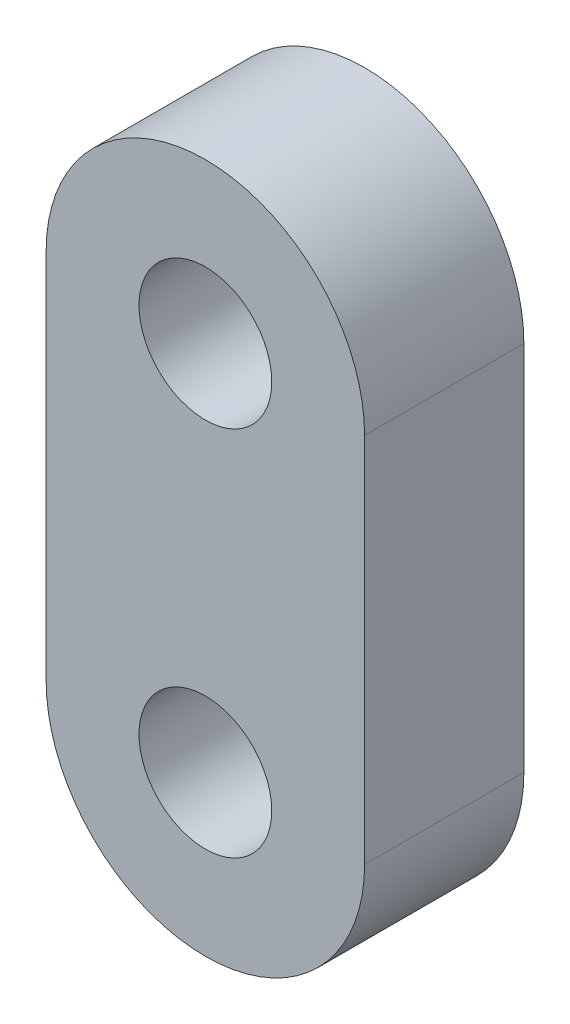
ISO-10303-21;
HEADER;
FILE_DESCRIPTION(('STEP AP214'),'2;1');
FILE_NAME('part.step','',(''),(''),'','','');
FILE_SCHEMA(('AUTOMOTIVE_DESIGN { 1 0 10303 214 1 1 1 1 }'));
ENDSEC;
DATA;
#1=APPLICATION_CONTEXT('core data for automotive mechanical design processes');
#2=APPLICATION_PROTOCOL_DEFINITION('international standard','automotive_design',2000,#1);
#3=PRODUCT_CONTEXT('',#1,'mechanical');
#4=PRODUCT('Part','Part','',(#3));
#5=PRODUCT_RELATED_PRODUCT_CATEGORY('part','',(#4));
#6=PRODUCT_DEFINITION_FORMATION('','',#4);
#7=PRODUCT_DEFINITION_CONTEXT('part definition',#1,'design');
#8=PRODUCT_DEFINITION('design','',#6,#7);
#9=PRODUCT_DEFINITION_SHAPE('','',#8);
#10=(LENGTH_UNIT() NAMED_UNIT(*) SI_UNIT(.MILLI.,.METRE.));
#11=(NAMED_UNIT(*) PLANE_ANGLE_UNIT() SI_UNIT($,.RADIAN.));
#12=(NAMED_UNIT(*) SI_UNIT($,.STERADIAN.) SOLID_ANGLE_UNIT());
#13=UNCERTAINTY_MEASURE_WITH_UNIT(LENGTH_MEASURE(1.E-05),#10,'distance_accuracy_value','');
#14=(GEOMETRIC_REPRESENTATION_CONTEXT(3) GLOBAL_UNCERTAINTY_ASSIGNED_CONTEXT((#13)) GLOBAL_UNIT_ASSIGNED_CONTEXT((#10,
#11,#12)) REPRESENTATION_CONTEXT('',''));
#15=CARTESIAN_POINT('',(0.,0.,0.));
#16=DIRECTION('',(0.,0.,1.));
#17=DIRECTION('',(1.,0.,0.));
#18=AXIS2_PLACEMENT_3D('',#15,#16,#17);
#19=CARTESIAN_POINT('',(0.,0.,3.));
#20=DIRECTION('',(0.,0.,1.));
#21=DIRECTION('',(1.,0.,0.));
#22=AXIS2_PLACEMENT_3D('',#19,#20,#21);
#23=PLANE('',#22);
#24=CARTESIAN_POINT('',(0.,0.,3.));
#25=DIRECTION('',(0.,0.,1.));
#26=DIRECTION('',(1.,0.,0.));
#27=AXIS2_PLACEMENT_3D('',#24,#25,#26);
#28=CIRCLE('',#27,1.25);
#29=CARTESIAN_POINT('',(1.25,0.,3.));
#30=VERTEX_POINT('',#29);
#31=EDGE_CURVE('E100',#30,#30,#28,.T.);
#32=ORIENTED_EDGE('',*,*,#31,.F.);
#33=EDGE_LOOP('',(#32));
#34=FACE_BOUND('',#33,.T.);
#35=CARTESIAN_POINT('',(0.,0.,3.));
#36=DIRECTION('',(0.,0.,1.));
#37=DIRECTION('',(1.,0.,0.));
#38=AXIS2_PLACEMENT_3D('',#35,#36,#37);
#39=CIRCLE('',#38,3.);
#40=CARTESIAN_POINT('',(3.,0.,3.));
#41=VERTEX_POINT('',#40);
#42=CARTESIAN_POINT('',(-3.,0.,3.));
#43=VERTEX_POINT('',#42);
#44=EDGE_CURVE('E85',#41,#43,#39,.T.);
#45=ORIENTED_EDGE('',*,*,#44,.T.);
#46=DIRECTION('',(0.,-1.,0.));
#47=VECTOR('',#46,1.);
#48=CARTESIAN_POINT('',(-3.,0.,3.));
#49=LINE('',#48,#47);
#50=CARTESIAN_POINT('',(-3.,-7.,3.));
#51=VERTEX_POINT('',#50);
#52=EDGE_CURVE('E80',#43,#51,#49,.T.);
#53=ORIENTED_EDGE('',*,*,#52,.T.);
#54=CARTESIAN_POINT('',(0.,-7.,3.));
#55=DIRECTION('',(0.,0.,1.));
#56=DIRECTION('',(1.,0.,0.));
#57=AXIS2_PLACEMENT_3D('',#54,#55,#56);
#58=CIRCLE('',#57,3.);
#59=CARTESIAN_POINT('',(3.,-7.,3.));
#60=VERTEX_POINT('',#59);
#61=EDGE_CURVE('E83',#51,#60,#58,.T.);
#62=ORIENTED_EDGE('',*,*,#61,.T.);
#63=DIRECTION('',(0.,1.,0.));
#64=VECTOR('',#63,1.);
#65=CARTESIAN_POINT('',(3.,0.,3.));
#66=LINE('',#65,#64);
#67=EDGE_CURVE('E50',#60,#41,#66,.T.);
#68=ORIENTED_EDGE('',*,*,#67,.T.);
#69=EDGE_LOOP('',(#45,#53,#62,#68));
#70=FACE_BOUND('',#69,.T.);
#71=CARTESIAN_POINT('',(0.,-7.,3.));
#72=DIRECTION('',(0.,0.,1.));
#73=DIRECTION('',(1.,0.,0.));
#74=AXIS2_PLACEMENT_3D('',#71,#72,#73);
#75=CIRCLE('',#74,1.25);
#76=CARTESIAN_POINT('',(1.25,-7.,3.));
#77=VERTEX_POINT('',#76);
#78=EDGE_CURVE('E115',#77,#77,#75,.T.);
#79=ORIENTED_EDGE('',*,*,#78,.F.);
#80=EDGE_LOOP('',(#79));
#81=FACE_BOUND('',#80,.T.);
#82=ADVANCED_FACE('F33',(#34,#70,#81),#23,.T.);
#83=CARTESIAN_POINT('',(0.,0.,0.));
#84=DIRECTION('',(0.,0.,1.));
#85=DIRECTION('',(1.,0.,0.));
#86=AXIS2_PLACEMENT_3D('',#83,#84,#85);
#87=PLANE('',#86);
#88=CARTESIAN_POINT('',(0.,0.,0.));
#89=DIRECTION('',(0.,0.,1.));
#90=DIRECTION('',(1.,0.,0.));
#91=AXIS2_PLACEMENT_3D('',#88,#89,#90);
#92=CIRCLE('',#91,1.25);
#93=CARTESIAN_POINT('',(1.25,0.,0.));
#94=VERTEX_POINT('',#93);
#95=EDGE_CURVE('E112',#94,#94,#92,.T.);
#96=ORIENTED_EDGE('',*,*,#95,.T.);
#97=EDGE_LOOP('',(#96));
#98=FACE_BOUND('',#97,.T.);
#99=CARTESIAN_POINT('',(0.,0.,0.));
#100=DIRECTION('',(0.,0.,1.));
#101=DIRECTION('',(1.,0.,0.));
#102=AXIS2_PLACEMENT_3D('',#99,#100,#101);
#103=CIRCLE('',#102,3.);
#104=CARTESIAN_POINT('',(3.,0.,0.));
#105=VERTEX_POINT('',#104);
#106=CARTESIAN_POINT('',(-3.,0.,0.));
#107=VERTEX_POINT('',#106);
#108=EDGE_CURVE('E97',#105,#107,#103,.T.);
#109=ORIENTED_EDGE('',*,*,#108,.F.);
#110=DIRECTION('',(0.,1.,0.));
#111=VECTOR('',#110,1.);
#112=CARTESIAN_POINT('',(3.,0.,0.));
#113=LINE('',#112,#111);
#114=CARTESIAN_POINT('',(3.,-7.,0.));
#115=VERTEX_POINT('',#114);
#116=EDGE_CURVE('E73',#115,#105,#113,.T.);
#117=ORIENTED_EDGE('',*,*,#116,.F.);
#118=CARTESIAN_POINT('',(0.,-7.,0.));
#119=DIRECTION('',(0.,0.,1.));
#120=DIRECTION('',(1.,0.,0.));
#121=AXIS2_PLACEMENT_3D('',#118,#119,#120);
#122=CIRCLE('',#121,3.);
#123=CARTESIAN_POINT('',(-3.,-7.,0.));
#124=VERTEX_POINT('',#123);
#125=EDGE_CURVE('E67',#124,#115,#122,.T.);
#126=ORIENTED_EDGE('',*,*,#125,.F.);
#127=DIRECTION('',(0.,-1.,0.));
#128=VECTOR('',#127,1.);
#129=CARTESIAN_POINT('',(-3.,0.,0.));
#130=LINE('',#129,#128);
#131=EDGE_CURVE('E89',#107,#124,#130,.T.);
#132=ORIENTED_EDGE('',*,*,#131,.F.);
#133=EDGE_LOOP('',(#109,#117,#126,#132));
#134=FACE_BOUND('',#133,.T.);
#135=CARTESIAN_POINT('',(0.,-7.,0.));
#136=DIRECTION('',(0.,0.,1.));
#137=DIRECTION('',(1.,0.,0.));
#138=AXIS2_PLACEMENT_3D('',#135,#136,#137);
#139=CIRCLE('',#138,1.25);
#140=CARTESIAN_POINT('',(1.25,-7.,0.));
#141=VERTEX_POINT('',#140);
#142=EDGE_CURVE('E118',#141,#141,#139,.T.);
#143=ORIENTED_EDGE('',*,*,#142,.T.);
#144=EDGE_LOOP('',(#143));
#145=FACE_BOUND('',#144,.T.);
#146=ADVANCED_FACE('F108',(#98,#134,#145),#87,.F.);
#147=CARTESIAN_POINT('',(0.,0.,3.));
#148=DIRECTION('',(0.,0.,-1.));
#149=DIRECTION('',(-1.,0.,0.));
#150=AXIS2_PLACEMENT_3D('',#147,#148,#149);
#151=CYLINDRICAL_SURFACE('',#150,3.);
#152=ORIENTED_EDGE('',*,*,#108,.T.);
#153=DIRECTION('',(0.,0.,-1.));
#154=VECTOR('',#153,1.);
#155=CARTESIAN_POINT('',(-3.,0.,3.));
#156=LINE('',#155,#154);
#157=EDGE_CURVE('E11',#43,#107,#156,.T.);
#158=ORIENTED_EDGE('',*,*,#157,.F.);
#159=ORIENTED_EDGE('',*,*,#44,.F.);
#160=DIRECTION('',(0.,0.,-1.));
#161=VECTOR('',#160,1.);
#162=CARTESIAN_POINT('',(3.,0.,3.));
#163=LINE('',#162,#161);
#164=EDGE_CURVE('E93',#41,#105,#163,.T.);
#165=ORIENTED_EDGE('',*,*,#164,.T.);
#166=EDGE_LOOP('',(#152,#158,#159,#165));
#167=FACE_BOUND('',#166,.T.);
#168=ADVANCED_FACE('F35',(#167),#151,.T.);
#169=CARTESIAN_POINT('',(-3.,0.,3.));
#170=DIRECTION('',(1.,0.,0.));
#171=DIRECTION('',(0.,1.,0.));
#172=AXIS2_PLACEMENT_3D('',#169,#170,#171);
#173=PLANE('',#172);
#174=ORIENTED_EDGE('',*,*,#131,.T.);
#175=DIRECTION('',(0.,0.,-1.));
#176=VECTOR('',#175,1.);
#177=CARTESIAN_POINT('',(-3.,-7.,3.));
#178=LINE('',#177,#176);
#179=EDGE_CURVE('E42',#51,#124,#178,.T.);
#180=ORIENTED_EDGE('',*,*,#179,.F.);
#181=ORIENTED_EDGE('',*,*,#52,.F.);
#182=ORIENTED_EDGE('',*,*,#157,.T.);
#183=EDGE_LOOP('',(#174,#180,#181,#182));
#184=FACE_BOUND('',#183,.T.);
#185=ADVANCED_FACE('F88',(#184),#173,.F.);
#186=CARTESIAN_POINT('',(0.,-7.,3.));
#187=DIRECTION('',(0.,0.,-1.));
#188=DIRECTION('',(-1.,0.,0.));
#189=AXIS2_PLACEMENT_3D('',#186,#187,#188);
#190=CYLINDRICAL_SURFACE('',#189,3.);
#191=ORIENTED_EDGE('',*,*,#125,.T.);
#192=DIRECTION('',(0.,0.,-1.));
#193=VECTOR('',#192,1.);
#194=CARTESIAN_POINT('',(3.,-7.,3.));
#195=LINE('',#194,#193);
#196=EDGE_CURVE('E90',#60,#115,#195,.T.);
#197=ORIENTED_EDGE('',*,*,#196,.F.);
#198=ORIENTED_EDGE('',*,*,#61,.F.);
#199=ORIENTED_EDGE('',*,*,#179,.T.);
#200=EDGE_LOOP('',(#191,#197,#198,#199));
#201=FACE_BOUND('',#200,.T.);
#202=ADVANCED_FACE('F91',(#201),#190,.T.);
#203=CARTESIAN_POINT('',(3.,0.,3.));
#204=DIRECTION('',(-1.,0.,0.));
#205=DIRECTION('',(0.,-1.,0.));
#206=AXIS2_PLACEMENT_3D('',#203,#204,#205);
#207=PLANE('',#206);
#208=ORIENTED_EDGE('',*,*,#116,.T.);
#209=ORIENTED_EDGE('',*,*,#164,.F.);
#210=ORIENTED_EDGE('',*,*,#67,.F.);
#211=ORIENTED_EDGE('',*,*,#196,.T.);
#212=EDGE_LOOP('',(#208,#209,#210,#211));
#213=FACE_BOUND('',#212,.T.);
#214=ADVANCED_FACE('F105',(#213),#207,.F.);
#215=CARTESIAN_POINT('',(0.,0.,3.));
#216=DIRECTION('',(0.,0.,-1.));
#217=DIRECTION('',(-1.,0.,0.));
#218=AXIS2_PLACEMENT_3D('',#215,#216,#217);
#219=CYLINDRICAL_SURFACE('',#218,1.25);
#220=ORIENTED_EDGE('',*,*,#31,.T.);
#221=EDGE_LOOP('',(#220));
#222=FACE_BOUND('',#221,.T.);
#223=ORIENTED_EDGE('',*,*,#95,.F.);
#224=EDGE_LOOP('',(#223));
#225=FACE_BOUND('',#224,.T.);
#226=ADVANCED_FACE('F136',(#222,#225),#219,.F.);
#227=CARTESIAN_POINT('',(0.,-7.,3.));
#228=DIRECTION('',(0.,0.,-1.));
#229=DIRECTION('',(-1.,0.,0.));
#230=AXIS2_PLACEMENT_3D('',#227,#228,#229);
#231=CYLINDRICAL_SURFACE('',#230,1.25);
#232=ORIENTED_EDGE('',*,*,#78,.T.);
#233=EDGE_LOOP('',(#232));
#234=FACE_BOUND('',#233,.T.);
#235=ORIENTED_EDGE('',*,*,#142,.F.);
#236=EDGE_LOOP('',(#235));
#237=FACE_BOUND('',#236,.T.);
#238=ADVANCED_FACE('F124',(#234,#237),#231,.F.);
#239=CLOSED_SHELL('',(#82,#146,#168,#185,#202,#214,#226,#238));
#240=MANIFOLD_SOLID_BREP('B2',#239);
#241=ADVANCED_BREP_SHAPE_REPRESENTATION('',(#18,#240),#14);
#242=SHAPE_DEFINITION_REPRESENTATION(#9,#241);
ENDSEC;
END-ISO-10303-21;
